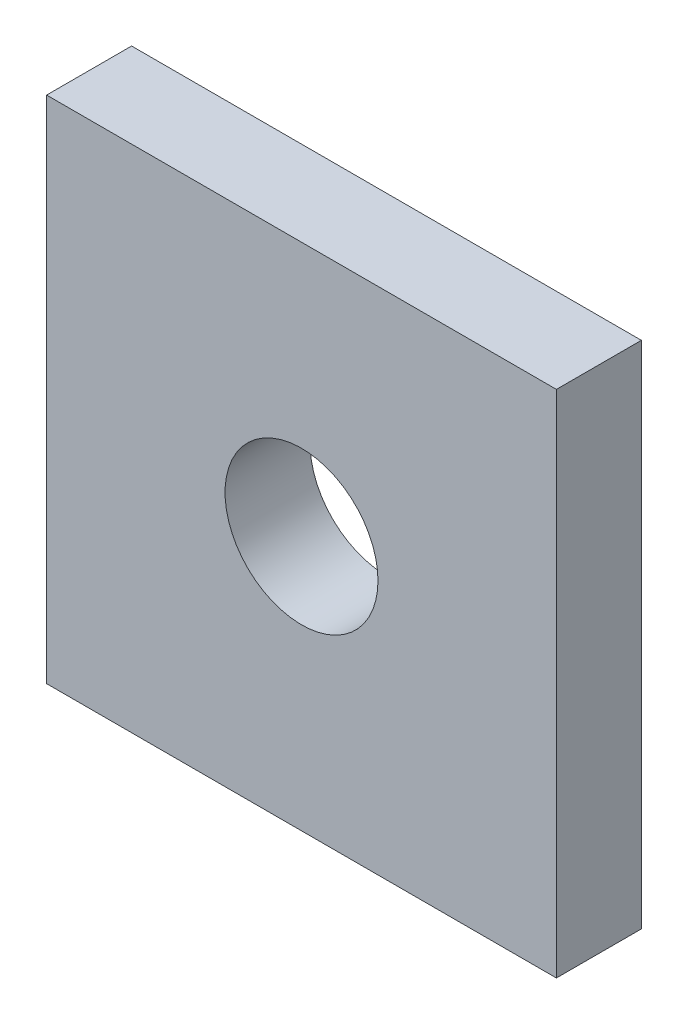
ISO-10303-21;
HEADER;
FILE_DESCRIPTION(('STEP AP214'),'2;1');
FILE_NAME('part.step','',(''),(''),'','','');
FILE_SCHEMA(('AUTOMOTIVE_DESIGN { 1 0 10303 214 1 1 1 1 }'));
ENDSEC;
DATA;
#1=APPLICATION_CONTEXT('core data for automotive mechanical design processes');
#2=APPLICATION_PROTOCOL_DEFINITION('international standard','automotive_design',2000,#1);
#3=PRODUCT_CONTEXT('',#1,'mechanical');
#4=PRODUCT('Part','Part','',(#3));
#5=PRODUCT_RELATED_PRODUCT_CATEGORY('part','',(#4));
#6=PRODUCT_DEFINITION_FORMATION('','',#4);
#7=PRODUCT_DEFINITION_CONTEXT('part definition',#1,'design');
#8=PRODUCT_DEFINITION('design','',#6,#7);
#9=PRODUCT_DEFINITION_SHAPE('','',#8);
#10=(LENGTH_UNIT() NAMED_UNIT(*) SI_UNIT(.MILLI.,.METRE.));
#11=(NAMED_UNIT(*) PLANE_ANGLE_UNIT() SI_UNIT($,.RADIAN.));
#12=(NAMED_UNIT(*) SI_UNIT($,.STERADIAN.) SOLID_ANGLE_UNIT());
#13=UNCERTAINTY_MEASURE_WITH_UNIT(LENGTH_MEASURE(1.E-05),#10,'distance_accuracy_value','');
#14=(GEOMETRIC_REPRESENTATION_CONTEXT(3) GLOBAL_UNCERTAINTY_ASSIGNED_CONTEXT((#13)) GLOBAL_UNIT_ASSIGNED_CONTEXT((#10,
#11,#12)) REPRESENTATION_CONTEXT('',''));
#15=CARTESIAN_POINT('',(0.,0.,0.));
#16=DIRECTION('',(0.,0.,1.));
#17=DIRECTION('',(1.,0.,0.));
#18=AXIS2_PLACEMENT_3D('',#15,#16,#17);
#19=CARTESIAN_POINT('',(0.,0.,5.));
#20=DIRECTION('',(0.,0.,1.));
#21=DIRECTION('',(1.,0.,0.));
#22=AXIS2_PLACEMENT_3D('',#19,#20,#21);
#23=PLANE('',#22);
#24=DIRECTION('',(0.,1.,0.));
#25=VECTOR('',#24,1.);
#26=CARTESIAN_POINT('',(15.,15.,5.));
#27=LINE('',#26,#25);
#28=CARTESIAN_POINT('',(15.,-15.,5.));
#29=VERTEX_POINT('',#28);
#30=CARTESIAN_POINT('',(15.,15.,5.));
#31=VERTEX_POINT('',#30);
#32=EDGE_CURVE('E86',#29,#31,#27,.T.);
#33=ORIENTED_EDGE('',*,*,#32,.T.);
#34=DIRECTION('',(-1.,0.,0.));
#35=VECTOR('',#34,1.);
#36=CARTESIAN_POINT('',(-15.,15.,5.));
#37=LINE('',#36,#35);
#38=CARTESIAN_POINT('',(-15.,15.,5.));
#39=VERTEX_POINT('',#38);
#40=EDGE_CURVE('E81',#31,#39,#37,.T.);
#41=ORIENTED_EDGE('',*,*,#40,.T.);
#42=DIRECTION('',(0.,-1.,0.));
#43=VECTOR('',#42,1.);
#44=CARTESIAN_POINT('',(-15.,15.,5.));
#45=LINE('',#44,#43);
#46=CARTESIAN_POINT('',(-15.,-15.,5.));
#47=VERTEX_POINT('',#46);
#48=EDGE_CURVE('E84',#39,#47,#45,.T.);
#49=ORIENTED_EDGE('',*,*,#48,.T.);
#50=DIRECTION('',(1.,0.,0.));
#51=VECTOR('',#50,1.);
#52=CARTESIAN_POINT('',(-15.,-15.,5.));
#53=LINE('',#52,#51);
#54=EDGE_CURVE('E51',#47,#29,#53,.T.);
#55=ORIENTED_EDGE('',*,*,#54,.T.);
#56=EDGE_LOOP('',(#33,#41,#49,#55));
#57=FACE_BOUND('',#56,.T.);
#58=CARTESIAN_POINT('',(0.,0.,5.));
#59=DIRECTION('',(0.,0.,1.));
#60=DIRECTION('',(1.,0.,0.));
#61=AXIS2_PLACEMENT_3D('',#58,#59,#60);
#62=CIRCLE('',#61,4.5);
#63=CARTESIAN_POINT('',(4.5,0.,5.));
#64=VERTEX_POINT('',#63);
#65=EDGE_CURVE('E101',#64,#64,#62,.T.);
#66=ORIENTED_EDGE('',*,*,#65,.F.);
#67=EDGE_LOOP('',(#66));
#68=FACE_BOUND('',#67,.T.);
#69=ADVANCED_FACE('F34',(#57,#68),#23,.T.);
#70=CARTESIAN_POINT('',(0.,0.,0.));
#71=DIRECTION('',(0.,0.,1.));
#72=DIRECTION('',(1.,0.,0.));
#73=AXIS2_PLACEMENT_3D('',#70,#71,#72);
#74=PLANE('',#73);
#75=DIRECTION('',(0.,1.,0.));
#76=VECTOR('',#75,1.);
#77=CARTESIAN_POINT('',(15.,15.,0.));
#78=LINE('',#77,#76);
#79=CARTESIAN_POINT('',(15.,-15.,0.));
#80=VERTEX_POINT('',#79);
#81=CARTESIAN_POINT('',(15.,15.,0.));
#82=VERTEX_POINT('',#81);
#83=EDGE_CURVE('E98',#80,#82,#78,.T.);
#84=ORIENTED_EDGE('',*,*,#83,.F.);
#85=DIRECTION('',(1.,0.,0.));
#86=VECTOR('',#85,1.);
#87=CARTESIAN_POINT('',(-15.,-15.,0.));
#88=LINE('',#87,#86);
#89=CARTESIAN_POINT('',(-15.,-15.,0.));
#90=VERTEX_POINT('',#89);
#91=EDGE_CURVE('E74',#90,#80,#88,.T.);
#92=ORIENTED_EDGE('',*,*,#91,.F.);
#93=DIRECTION('',(0.,-1.,0.));
#94=VECTOR('',#93,1.);
#95=CARTESIAN_POINT('',(-15.,15.,0.));
#96=LINE('',#95,#94);
#97=CARTESIAN_POINT('',(-15.,15.,0.));
#98=VERTEX_POINT('',#97);
#99=EDGE_CURVE('E68',#98,#90,#96,.T.);
#100=ORIENTED_EDGE('',*,*,#99,.F.);
#101=DIRECTION('',(-1.,0.,0.));
#102=VECTOR('',#101,1.);
#103=CARTESIAN_POINT('',(-15.,15.,0.));
#104=LINE('',#103,#102);
#105=EDGE_CURVE('E90',#82,#98,#104,.T.);
#106=ORIENTED_EDGE('',*,*,#105,.F.);
#107=EDGE_LOOP('',(#84,#92,#100,#106));
#108=FACE_BOUND('',#107,.T.);
#109=CARTESIAN_POINT('',(0.,0.,0.));
#110=DIRECTION('',(0.,0.,1.));
#111=DIRECTION('',(1.,0.,0.));
#112=AXIS2_PLACEMENT_3D('',#109,#110,#111);
#113=CIRCLE('',#112,4.5);
#114=CARTESIAN_POINT('',(4.5,0.,0.));
#115=VERTEX_POINT('',#114);
#116=EDGE_CURVE('E113',#115,#115,#113,.T.);
#117=ORIENTED_EDGE('',*,*,#116,.T.);
#118=EDGE_LOOP('',(#117));
#119=FACE_BOUND('',#118,.T.);
#120=ADVANCED_FACE('F109',(#108,#119),#74,.F.);
#121=CARTESIAN_POINT('',(15.,15.,5.));
#122=DIRECTION('',(-1.,0.,0.));
#123=DIRECTION('',(0.,-1.,0.));
#124=AXIS2_PLACEMENT_3D('',#121,#122,#123);
#125=PLANE('',#124);
#126=ORIENTED_EDGE('',*,*,#83,.T.);
#127=DIRECTION('',(0.,0.,-1.));
#128=VECTOR('',#127,1.);
#129=CARTESIAN_POINT('',(15.,15.,5.));
#130=LINE('',#129,#128);
#131=EDGE_CURVE('E11',#31,#82,#130,.T.);
#132=ORIENTED_EDGE('',*,*,#131,.F.);
#133=ORIENTED_EDGE('',*,*,#32,.F.);
#134=DIRECTION('',(0.,0.,-1.));
#135=VECTOR('',#134,1.);
#136=CARTESIAN_POINT('',(15.,-15.,5.));
#137=LINE('',#136,#135);
#138=EDGE_CURVE('E94',#29,#80,#137,.T.);
#139=ORIENTED_EDGE('',*,*,#138,.T.);
#140=EDGE_LOOP('',(#126,#132,#133,#139));
#141=FACE_BOUND('',#140,.T.);
#142=ADVANCED_FACE('F36',(#141),#125,.F.);
#143=CARTESIAN_POINT('',(-15.,15.,5.));
#144=DIRECTION('',(0.,-1.,0.));
#145=DIRECTION('',(0.,0.,-1.));
#146=AXIS2_PLACEMENT_3D('',#143,#144,#145);
#147=PLANE('',#146);
#148=ORIENTED_EDGE('',*,*,#105,.T.);
#149=DIRECTION('',(0.,0.,-1.));
#150=VECTOR('',#149,1.);
#151=CARTESIAN_POINT('',(-15.,15.,5.));
#152=LINE('',#151,#150);
#153=EDGE_CURVE('E43',#39,#98,#152,.T.);
#154=ORIENTED_EDGE('',*,*,#153,.F.);
#155=ORIENTED_EDGE('',*,*,#40,.F.);
#156=ORIENTED_EDGE('',*,*,#131,.T.);
#157=EDGE_LOOP('',(#148,#154,#155,#156));
#158=FACE_BOUND('',#157,.T.);
#159=ADVANCED_FACE('F89',(#158),#147,.F.);
#160=CARTESIAN_POINT('',(-15.,15.,5.));
#161=DIRECTION('',(1.,0.,0.));
#162=DIRECTION('',(0.,1.,0.));
#163=AXIS2_PLACEMENT_3D('',#160,#161,#162);
#164=PLANE('',#163);
#165=ORIENTED_EDGE('',*,*,#99,.T.);
#166=DIRECTION('',(0.,0.,-1.));
#167=VECTOR('',#166,1.);
#168=CARTESIAN_POINT('',(-15.,-15.,5.));
#169=LINE('',#168,#167);
#170=EDGE_CURVE('E91',#47,#90,#169,.T.);
#171=ORIENTED_EDGE('',*,*,#170,.F.);
#172=ORIENTED_EDGE('',*,*,#48,.F.);
#173=ORIENTED_EDGE('',*,*,#153,.T.);
#174=EDGE_LOOP('',(#165,#171,#172,#173));
#175=FACE_BOUND('',#174,.T.);
#176=ADVANCED_FACE('F92',(#175),#164,.F.);
#177=CARTESIAN_POINT('',(-15.,-15.,5.));
#178=DIRECTION('',(0.,1.,0.));
#179=DIRECTION('',(0.,0.,1.));
#180=AXIS2_PLACEMENT_3D('',#177,#178,#179);
#181=PLANE('',#180);
#182=ORIENTED_EDGE('',*,*,#91,.T.);
#183=ORIENTED_EDGE('',*,*,#138,.F.);
#184=ORIENTED_EDGE('',*,*,#54,.F.);
#185=ORIENTED_EDGE('',*,*,#170,.T.);
#186=EDGE_LOOP('',(#182,#183,#184,#185));
#187=FACE_BOUND('',#186,.T.);
#188=ADVANCED_FACE('F106',(#187),#181,.F.);
#189=CARTESIAN_POINT('',(0.,0.,5.));
#190=DIRECTION('',(0.,0.,-1.));
#191=DIRECTION('',(-1.,0.,0.));
#192=AXIS2_PLACEMENT_3D('',#189,#190,#191);
#193=CYLINDRICAL_SURFACE('',#192,4.5);
#194=ORIENTED_EDGE('',*,*,#65,.T.);
#195=EDGE_LOOP('',(#194));
#196=FACE_BOUND('',#195,.T.);
#197=ORIENTED_EDGE('',*,*,#116,.F.);
#198=EDGE_LOOP('',(#197));
#199=FACE_BOUND('',#198,.T.);
#200=ADVANCED_FACE('F119',(#196,#199),#193,.F.);
#201=CLOSED_SHELL('',(#69,#120,#142,#159,#176,#188,#200));
#202=MANIFOLD_SOLID_BREP('B2',#201);
#203=ADVANCED_BREP_SHAPE_REPRESENTATION('',(#18,#202),#14);
#204=SHAPE_DEFINITION_REPRESENTATION(#9,#203);
ENDSEC;
END-ISO-10303-21;
